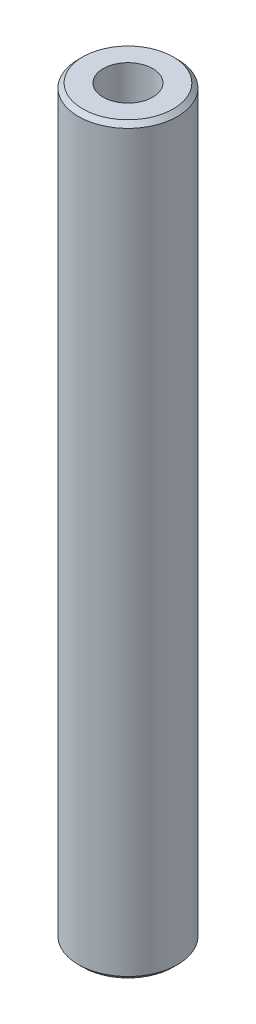
ISO-10303-21;
HEADER;
FILE_DESCRIPTION(('STEP AP214'),'2;1');
FILE_NAME('part.step','',(''),(''),'','','');
FILE_SCHEMA(('AUTOMOTIVE_DESIGN { 1 0 10303 214 1 1 1 1 }'));
ENDSEC;
DATA;
#1=APPLICATION_CONTEXT('core data for automotive mechanical design processes');
#2=APPLICATION_PROTOCOL_DEFINITION('international standard','automotive_design',2000,#1);
#3=PRODUCT_CONTEXT('',#1,'mechanical');
#4=PRODUCT('Part','Part','',(#3));
#5=PRODUCT_RELATED_PRODUCT_CATEGORY('part','',(#4));
#6=PRODUCT_DEFINITION_FORMATION('','',#4);
#7=PRODUCT_DEFINITION_CONTEXT('part definition',#1,'design');
#8=PRODUCT_DEFINITION('design','',#6,#7);
#9=PRODUCT_DEFINITION_SHAPE('','',#8);
#10=(LENGTH_UNIT() NAMED_UNIT(*) SI_UNIT(.MILLI.,.METRE.));
#11=(NAMED_UNIT(*) PLANE_ANGLE_UNIT() SI_UNIT($,.RADIAN.));
#12=(NAMED_UNIT(*) SI_UNIT($,.STERADIAN.) SOLID_ANGLE_UNIT());
#13=UNCERTAINTY_MEASURE_WITH_UNIT(LENGTH_MEASURE(1.E-05),#10,'distance_accuracy_value','');
#14=(GEOMETRIC_REPRESENTATION_CONTEXT(3) GLOBAL_UNCERTAINTY_ASSIGNED_CONTEXT((#13)) GLOBAL_UNIT_ASSIGNED_CONTEXT((#10,
#11,#12)) REPRESENTATION_CONTEXT('',''));
#15=CARTESIAN_POINT('',(0.,0.,0.));
#16=DIRECTION('',(0.,0.,1.));
#17=DIRECTION('',(1.,0.,0.));
#18=AXIS2_PLACEMENT_3D('',#15,#16,#17);
#19=CARTESIAN_POINT('',(0.,600.,0.));
#20=DIRECTION('',(0.,-1.,0.));
#21=DIRECTION('',(0.,0.,-1.));
#22=AXIS2_PLACEMENT_3D('',#19,#20,#21);
#23=CYLINDRICAL_SURFACE('',#22,40.);
#24=CARTESIAN_POINT('',(0.,596.472077962551,0.));
#25=DIRECTION('',(0.,1.,0.));
#26=DIRECTION('',(0.,0.,1.));
#27=AXIS2_PLACEMENT_3D('',#24,#25,#26);
#28=CIRCLE('',#27,40.);
#29=CARTESIAN_POINT('',(0.,596.472077962551,40.));
#30=VERTEX_POINT('',#29);
#31=EDGE_CURVE('E50',#30,#30,#28,.F.);
#32=ORIENTED_EDGE('',*,*,#31,.T.);
#33=EDGE_LOOP('',(#32));
#34=FACE_BOUND('',#33,.T.);
#35=CARTESIAN_POINT('',(0.,3.52792203744901,0.));
#36=DIRECTION('',(0.,1.,0.));
#37=DIRECTION('',(0.,0.,1.));
#38=AXIS2_PLACEMENT_3D('',#35,#36,#37);
#39=CIRCLE('',#38,40.);
#40=CARTESIAN_POINT('',(0.,3.52792203744901,40.));
#41=VERTEX_POINT('',#40);
#42=EDGE_CURVE('E51',#41,#41,#39,.T.);
#43=ORIENTED_EDGE('',*,*,#42,.T.);
#44=EDGE_LOOP('',(#43));
#45=FACE_BOUND('',#44,.T.);
#46=ADVANCED_FACE('F39',(#34,#45),#23,.T.);
#47=CARTESIAN_POINT('',(0.,600.,0.));
#48=DIRECTION('',(0.,1.,0.));
#49=DIRECTION('',(0.,0.,1.));
#50=AXIS2_PLACEMENT_3D('',#47,#48,#49);
#51=PLANE('',#50);
#52=CARTESIAN_POINT('',(0.,600.,0.));
#53=DIRECTION('',(0.,1.,0.));
#54=DIRECTION('',(0.,0.,1.));
#55=AXIS2_PLACEMENT_3D('',#52,#53,#54);
#56=CIRCLE('',#55,36.4720779625511);
#57=CARTESIAN_POINT('',(0.,600.,36.4720779625511));
#58=VERTEX_POINT('',#57);
#59=EDGE_CURVE('E54',#58,#58,#56,.T.);
#60=ORIENTED_EDGE('',*,*,#59,.T.);
#61=EDGE_LOOP('',(#60));
#62=FACE_BOUND('',#61,.T.);
#63=CARTESIAN_POINT('',(0.,600.,0.));
#64=DIRECTION('',(0.,1.,0.));
#65=DIRECTION('',(0.,0.,1.));
#66=AXIS2_PLACEMENT_3D('',#63,#64,#65);
#67=CIRCLE('',#66,20.0099399643938);
#68=CARTESIAN_POINT('',(0.,600.,20.0099399643938));
#69=VERTEX_POINT('',#68);
#70=EDGE_CURVE('E58',#69,#69,#67,.T.);
#71=ORIENTED_EDGE('',*,*,#70,.F.);
#72=EDGE_LOOP('',(#71));
#73=FACE_BOUND('',#72,.T.);
#74=ADVANCED_FACE('F69',(#62,#73),#51,.T.);
#75=CARTESIAN_POINT('',(0.,0.,0.));
#76=DIRECTION('',(0.,1.,0.));
#77=DIRECTION('',(0.,0.,1.));
#78=AXIS2_PLACEMENT_3D('',#75,#76,#77);
#79=PLANE('',#78);
#80=CARTESIAN_POINT('',(0.,0.,0.));
#81=DIRECTION('',(0.,1.,0.));
#82=DIRECTION('',(0.,0.,1.));
#83=AXIS2_PLACEMENT_3D('',#80,#81,#82);
#84=CIRCLE('',#83,36.472077962551);
#85=CARTESIAN_POINT('',(0.,0.,36.472077962551));
#86=VERTEX_POINT('',#85);
#87=EDGE_CURVE('E10',#86,#86,#84,.F.);
#88=ORIENTED_EDGE('',*,*,#87,.T.);
#89=EDGE_LOOP('',(#88));
#90=FACE_BOUND('',#89,.T.);
#91=CARTESIAN_POINT('',(0.,0.,0.));
#92=DIRECTION('',(0.,1.,0.));
#93=DIRECTION('',(0.,0.,1.));
#94=AXIS2_PLACEMENT_3D('',#91,#92,#93);
#95=CIRCLE('',#94,20.0099399643938);
#96=CARTESIAN_POINT('',(0.,0.,20.0099399643938));
#97=VERTEX_POINT('',#96);
#98=EDGE_CURVE('E63',#97,#97,#95,.T.);
#99=ORIENTED_EDGE('',*,*,#98,.T.);
#100=EDGE_LOOP('',(#99));
#101=FACE_BOUND('',#100,.T.);
#102=ADVANCED_FACE('F75',(#90,#101),#79,.F.);
#103=CARTESIAN_POINT('',(0.,600.,0.));
#104=DIRECTION('',(0.,-1.,0.));
#105=DIRECTION('',(0.,0.,-1.));
#106=AXIS2_PLACEMENT_3D('',#103,#104,#105);
#107=CYLINDRICAL_SURFACE('',#106,20.0099399643938);
#108=ORIENTED_EDGE('',*,*,#70,.T.);
#109=EDGE_LOOP('',(#108));
#110=FACE_BOUND('',#109,.T.);
#111=ORIENTED_EDGE('',*,*,#98,.F.);
#112=EDGE_LOOP('',(#111));
#113=FACE_BOUND('',#112,.T.);
#114=ADVANCED_FACE('F70',(#110,#113),#107,.F.);
#115=CARTESIAN_POINT('',(0.,600.,0.));
#116=DIRECTION('',(0.,-1.,0.));
#117=DIRECTION('',(0.,0.,-1.));
#118=AXIS2_PLACEMENT_3D('',#115,#116,#117);
#119=CONICAL_SURFACE('',#118,36.4720779625511,0.785398163397428);
#120=ORIENTED_EDGE('',*,*,#31,.F.);
#121=EDGE_LOOP('',(#120));
#122=FACE_BOUND('',#121,.T.);
#123=ORIENTED_EDGE('',*,*,#59,.F.);
#124=EDGE_LOOP('',(#123));
#125=FACE_BOUND('',#124,.T.);
#126=ADVANCED_FACE('F81',(#122,#125),#119,.T.);
#127=CARTESIAN_POINT('',(0.,3.52792203744901,0.));
#128=DIRECTION('',(0.,1.,0.));
#129=DIRECTION('',(0.,0.,1.));
#130=AXIS2_PLACEMENT_3D('',#127,#128,#129);
#131=CONICAL_SURFACE('',#130,40.,0.785398163397443);
#132=ORIENTED_EDGE('',*,*,#87,.F.);
#133=EDGE_LOOP('',(#132));
#134=FACE_BOUND('',#133,.T.);
#135=ORIENTED_EDGE('',*,*,#42,.F.);
#136=EDGE_LOOP('',(#135));
#137=FACE_BOUND('',#136,.T.);
#138=ADVANCED_FACE('F45',(#134,#137),#131,.T.);
#139=CLOSED_SHELL('',(#46,#74,#102,#114,#126,#138));
#140=MANIFOLD_SOLID_BREP('B2',#139);
#141=ADVANCED_BREP_SHAPE_REPRESENTATION('',(#18,#140),#14);
#142=SHAPE_DEFINITION_REPRESENTATION(#9,#141);
ENDSEC;
END-ISO-10303-21;
